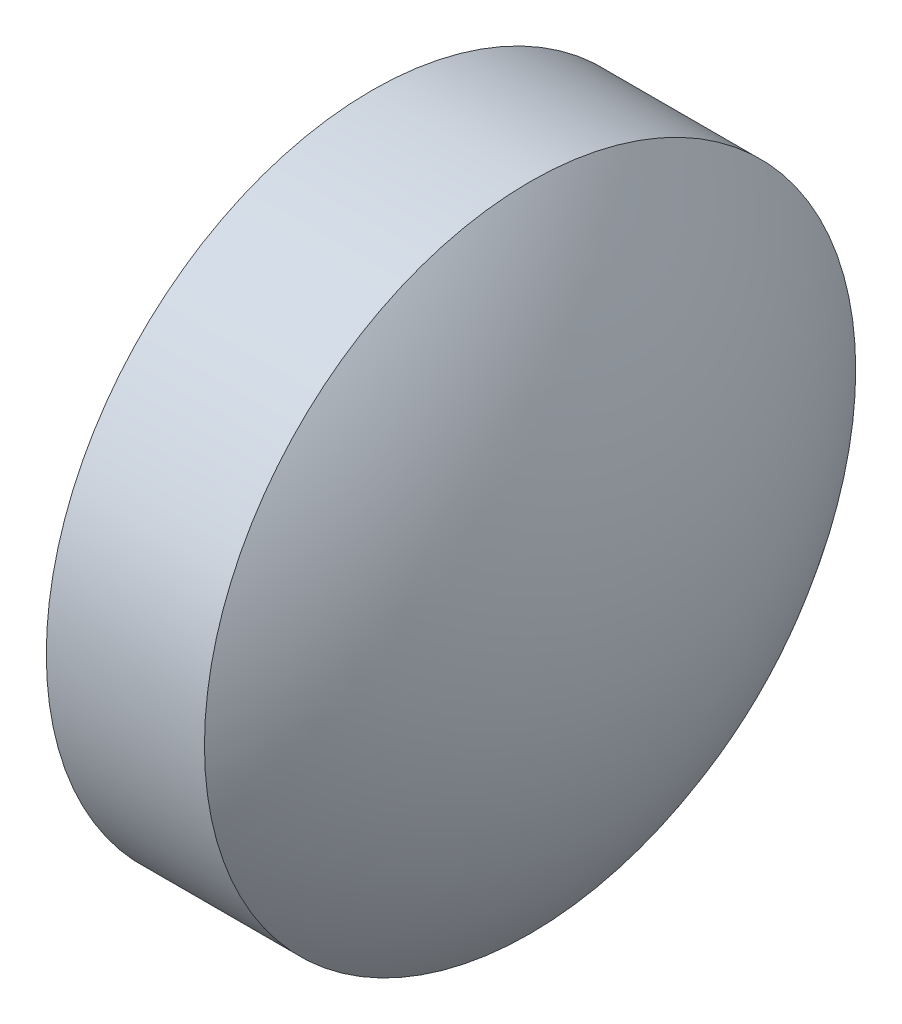
ISO-10303-21;
HEADER;
FILE_DESCRIPTION(('STEP AP214'),'2;1');
FILE_NAME('part.step','',(''),(''),'','','');
FILE_SCHEMA(('AUTOMOTIVE_DESIGN { 1 0 10303 214 1 1 1 1 }'));
ENDSEC;
DATA;
#1=APPLICATION_CONTEXT('core data for automotive mechanical design processes');
#2=APPLICATION_PROTOCOL_DEFINITION('international standard','automotive_design',2000,#1);
#3=PRODUCT_CONTEXT('',#1,'mechanical');
#4=PRODUCT('Part','Part','',(#3));
#5=PRODUCT_RELATED_PRODUCT_CATEGORY('part','',(#4));
#6=PRODUCT_DEFINITION_FORMATION('','',#4);
#7=PRODUCT_DEFINITION_CONTEXT('part definition',#1,'design');
#8=PRODUCT_DEFINITION('design','',#6,#7);
#9=PRODUCT_DEFINITION_SHAPE('','',#8);
#10=(LENGTH_UNIT() NAMED_UNIT(*) SI_UNIT(.MILLI.,.METRE.));
#11=(NAMED_UNIT(*) PLANE_ANGLE_UNIT() SI_UNIT($,.RADIAN.));
#12=(NAMED_UNIT(*) SI_UNIT($,.STERADIAN.) SOLID_ANGLE_UNIT());
#13=UNCERTAINTY_MEASURE_WITH_UNIT(LENGTH_MEASURE(1.E-05),#10,'distance_accuracy_value','');
#14=(GEOMETRIC_REPRESENTATION_CONTEXT(3) GLOBAL_UNCERTAINTY_ASSIGNED_CONTEXT((#13)) GLOBAL_UNIT_ASSIGNED_CONTEXT((#10,
#11,#12)) REPRESENTATION_CONTEXT('',''));
#15=CARTESIAN_POINT('',(0.,0.,0.));
#16=DIRECTION('',(0.,0.,1.));
#17=DIRECTION('',(1.,0.,0.));
#18=AXIS2_PLACEMENT_3D('',#15,#16,#17);
#19=CARTESIAN_POINT('',(484.395803583666,143.668782463315,0.));
#20=DIRECTION('',(-1.,0.,0.));
#21=DIRECTION('',(0.,1.,0.));
#22=AXIS2_PLACEMENT_3D('',#19,#20,#21);
#23=SPHERICAL_SURFACE('',#22,5.17168224299068);
#24=CARTESIAN_POINT('',(488.497485826656,143.668782463315,0.));
#25=DIRECTION('',(-1.,0.,0.));
#26=DIRECTION('',(0.,0.,1.));
#27=AXIS2_PLACEMENT_3D('',#24,#25,#26);
#28=CIRCLE('',#27,3.14999999999996);
#29=CARTESIAN_POINT('',(488.497485826656,143.668782463315,3.14999999999996));
#30=VERTEX_POINT('',#29);
#31=EDGE_CURVE('E10',#30,#30,#28,.T.);
#32=ORIENTED_EDGE('',*,*,#31,.F.);
#33=EDGE_LOOP('',(#32));
#34=FACE_BOUND('',#33,.T.);
#35=ADVANCED_FACE('F35',(#34),#23,.T.);
#36=CARTESIAN_POINT('',(486.477827843063,143.668782463315,0.));
#37=DIRECTION('',(-1.,0.,0.));
#38=DIRECTION('',(0.,0.,1.));
#39=AXIS2_PLACEMENT_3D('',#36,#37,#38);
#40=CYLINDRICAL_SURFACE('',#39,3.14999999999996);
#41=CARTESIAN_POINT('',(486.967485826656,143.668782463315,0.));
#42=DIRECTION('',(-1.,0.,0.));
#43=DIRECTION('',(0.,0.,1.));
#44=AXIS2_PLACEMENT_3D('',#41,#42,#43);
#45=CIRCLE('',#44,3.14999999999996);
#46=CARTESIAN_POINT('',(486.967485826656,143.668782463315,3.14999999999996));
#47=VERTEX_POINT('',#46);
#48=EDGE_CURVE('E41',#47,#47,#45,.T.);
#49=ORIENTED_EDGE('',*,*,#48,.F.);
#50=EDGE_LOOP('',(#49));
#51=FACE_BOUND('',#50,.T.);
#52=ORIENTED_EDGE('',*,*,#31,.T.);
#53=EDGE_LOOP('',(#52));
#54=FACE_BOUND('',#53,.T.);
#55=ADVANCED_FACE('F49',(#51,#54),#40,.T.);
#56=CARTESIAN_POINT('',(486.967485826656,143.668782463315,0.));
#57=DIRECTION('',(1.,0.,0.));
#58=DIRECTION('',(0.,0.,-1.));
#59=AXIS2_PLACEMENT_3D('',#56,#57,#58);
#60=PLANE('',#59);
#61=ORIENTED_EDGE('',*,*,#48,.T.);
#62=EDGE_LOOP('',(#61));
#63=FACE_BOUND('',#62,.T.);
#64=ADVANCED_FACE('F47',(#63),#60,.F.);
#65=CLOSED_SHELL('',(#35,#55,#64));
#66=MANIFOLD_SOLID_BREP('B2',#65);
#67=ADVANCED_BREP_SHAPE_REPRESENTATION('',(#18,#66),#14);
#68=SHAPE_DEFINITION_REPRESENTATION(#9,#67);
ENDSEC;
END-ISO-10303-21;
